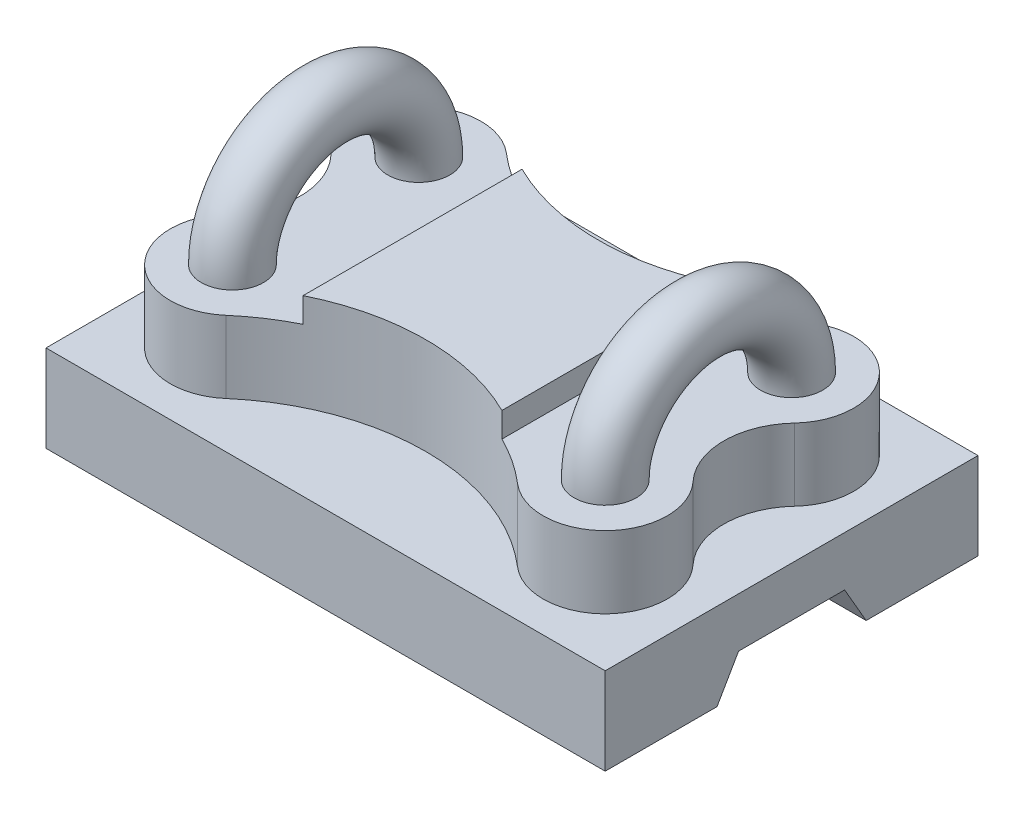
ISO-10303-21;
HEADER;
FILE_DESCRIPTION(('STEP AP214'),'2;1');
FILE_NAME('part.step','',(''),(''),'','','');
FILE_SCHEMA(('AUTOMOTIVE_DESIGN { 1 0 10303 214 1 1 1 1 }'));
ENDSEC;
DATA;
#1=APPLICATION_CONTEXT('core data for automotive mechanical design processes');
#2=APPLICATION_PROTOCOL_DEFINITION('international standard','automotive_design',2000,#1);
#3=PRODUCT_CONTEXT('',#1,'mechanical');
#4=PRODUCT('Part','Part','',(#3));
#5=PRODUCT_RELATED_PRODUCT_CATEGORY('part','',(#4));
#6=PRODUCT_DEFINITION_FORMATION('','',#4);
#7=PRODUCT_DEFINITION_CONTEXT('part definition',#1,'design');
#8=PRODUCT_DEFINITION('design','',#6,#7);
#9=PRODUCT_DEFINITION_SHAPE('','',#8);
#10=(LENGTH_UNIT() NAMED_UNIT(*) SI_UNIT(.MILLI.,.METRE.));
#11=(NAMED_UNIT(*) PLANE_ANGLE_UNIT() SI_UNIT($,.RADIAN.));
#12=(NAMED_UNIT(*) SI_UNIT($,.STERADIAN.) SOLID_ANGLE_UNIT());
#13=UNCERTAINTY_MEASURE_WITH_UNIT(LENGTH_MEASURE(1.E-05),#10,'distance_accuracy_value','');
#14=(GEOMETRIC_REPRESENTATION_CONTEXT(3) GLOBAL_UNCERTAINTY_ASSIGNED_CONTEXT((#13)) GLOBAL_UNIT_ASSIGNED_CONTEXT((#10,
#11,#12)) REPRESENTATION_CONTEXT('',''));
#15=CARTESIAN_POINT('',(0.,0.,0.));
#16=DIRECTION('',(0.,0.,1.));
#17=DIRECTION('',(1.,0.,0.));
#18=AXIS2_PLACEMENT_3D('',#15,#16,#17);
#19=CARTESIAN_POINT('',(0.,128.,0.));
#20=DIRECTION('',(0.,1.,0.));
#21=DIRECTION('',(0.,0.,1.));
#22=AXIS2_PLACEMENT_3D('',#19,#20,#21);
#23=PLANE('',#22);
#24=CARTESIAN_POINT('',(150.,128.,-74.9999999999999));
#25=DIRECTION('',(0.,1.,0.));
#26=DIRECTION('',(0.,0.,-1.));
#27=AXIS2_PLACEMENT_3D('',#24,#25,#26);
#28=CIRCLE('',#27,25.);
#29=CARTESIAN_POINT('',(150.,128.,-100.));
#30=VERTEX_POINT('',#29);
#31=EDGE_CURVE('E452',#30,#30,#28,.T.);
#32=ORIENTED_EDGE('',*,*,#31,.F.);
#33=EDGE_LOOP('',(#32));
#34=FACE_BOUND('',#33,.T.);
#35=CARTESIAN_POINT('',(150.,127.999999999999,74.9999999999999));
#36=DIRECTION('',(0.,-1.,0.));
#37=DIRECTION('',(0.,0.,1.));
#38=AXIS2_PLACEMENT_3D('',#35,#36,#37);
#39=CIRCLE('',#38,25.);
#40=CARTESIAN_POINT('',(150.,127.999999999999,99.9999999999999));
#41=VERTEX_POINT('',#40);
#42=EDGE_CURVE('E448',#41,#41,#39,.T.);
#43=ORIENTED_EDGE('',*,*,#42,.T.);
#44=EDGE_LOOP('',(#43));
#45=FACE_BOUND('',#44,.T.);
#46=DIRECTION('',(0.,0.,-1.));
#47=VECTOR('',#46,1.);
#48=CARTESIAN_POINT('',(80.,128.,-88.110802775656));
#49=LINE('',#48,#47);
#50=CARTESIAN_POINT('',(80.,128.,88.110802775656));
#51=VERTEX_POINT('',#50);
#52=CARTESIAN_POINT('',(80.,128.,-88.110802775656));
#53=VERTEX_POINT('',#52);
#54=EDGE_CURVE('E201',#51,#53,#49,.T.);
#55=ORIENTED_EDGE('',*,*,#54,.F.);
#56=CARTESIAN_POINT('',(0.,128.,249.355957741627));
#57=DIRECTION('',(0.,1.,0.));
#58=DIRECTION('',(0.,0.,1.));
#59=AXIS2_PLACEMENT_3D('',#56,#57,#58);
#60=CIRCLE('',#59,180.);
#61=CARTESIAN_POINT('',(117.391304347826,128.,112.903469074267));
#62=VERTEX_POINT('',#61);
#63=EDGE_CURVE('E221',#51,#62,#60,.F.);
#64=ORIENTED_EDGE('',*,*,#63,.T.);
#65=CARTESIAN_POINT('',(150.,128.,75.));
#66=DIRECTION('',(0.,1.,0.));
#67=DIRECTION('',(0.,0.,1.));
#68=AXIS2_PLACEMENT_3D('',#65,#66,#67);
#69=CIRCLE('',#68,50.);
#70=CARTESIAN_POINT('',(186.576083953252,128.,40.9090909090909));
#71=VERTEX_POINT('',#70);
#72=EDGE_CURVE('E226',#62,#71,#69,.T.);
#73=ORIENTED_EDGE('',*,*,#72,.T.);
#74=CARTESIAN_POINT('',(230.467384697155,128.,0.));
#75=DIRECTION('',(0.,1.,0.));
#76=DIRECTION('',(0.,0.,1.));
#77=AXIS2_PLACEMENT_3D('',#74,#75,#76);
#78=CIRCLE('',#77,60.);
#79=CARTESIAN_POINT('',(186.576083953252,128.,-40.9090909090909));
#80=VERTEX_POINT('',#79);
#81=EDGE_CURVE('E229',#71,#80,#78,.F.);
#82=ORIENTED_EDGE('',*,*,#81,.T.);
#83=CARTESIAN_POINT('',(150.,128.,-75.));
#84=DIRECTION('',(0.,1.,0.));
#85=DIRECTION('',(0.,0.,1.));
#86=AXIS2_PLACEMENT_3D('',#83,#84,#85);
#87=CIRCLE('',#86,50.);
#88=CARTESIAN_POINT('',(117.391304347826,128.,-112.903469074267));
#89=VERTEX_POINT('',#88);
#90=EDGE_CURVE('E232',#89,#80,#87,.F.);
#91=ORIENTED_EDGE('',*,*,#90,.F.);
#92=CARTESIAN_POINT('',(0.,128.,-249.355957741627));
#93=DIRECTION('',(0.,1.,0.));
#94=DIRECTION('',(0.,0.,1.));
#95=AXIS2_PLACEMENT_3D('',#92,#93,#94);
#96=CIRCLE('',#95,180.);
#97=EDGE_CURVE('E57',#53,#89,#96,.T.);
#98=ORIENTED_EDGE('',*,*,#97,.F.);
#99=EDGE_LOOP('',(#55,#64,#73,#82,#91,#98));
#100=FACE_BOUND('',#99,.T.);
#101=ADVANCED_FACE('F41',(#34,#45,#100),#23,.T.);
#102=CARTESIAN_POINT('',(225.,70.,-150.));
#103=DIRECTION('',(-1.,0.,0.));
#104=DIRECTION('',(0.,0.,1.));
#105=AXIS2_PLACEMENT_3D('',#102,#103,#104);
#106=PLANE('',#105);
#107=DIRECTION('',(0.,0.86602540378444,-0.499999999999998));
#108=VECTOR('',#107,1.);
#109=CARTESIAN_POINT('',(225.,0.,60.));
#110=LINE('',#109,#108);
#111=CARTESIAN_POINT('',(225.,0.,60.));
#112=VERTEX_POINT('',#111);
#113=CARTESIAN_POINT('',(225.,30.,42.6794919243113));
#114=VERTEX_POINT('',#113);
#115=EDGE_CURVE('E300',#112,#114,#110,.T.);
#116=ORIENTED_EDGE('',*,*,#115,.T.);
#117=DIRECTION('',(0.,0.,-1.));
#118=VECTOR('',#117,1.);
#119=CARTESIAN_POINT('',(225.,30.,42.6794919243113));
#120=LINE('',#119,#118);
#121=CARTESIAN_POINT('',(225.,30.,-42.6794919243113));
#122=VERTEX_POINT('',#121);
#123=EDGE_CURVE('E316',#114,#122,#120,.T.);
#124=ORIENTED_EDGE('',*,*,#123,.T.);
#125=DIRECTION('',(0.,0.86602540378444,0.499999999999998));
#126=VECTOR('',#125,1.);
#127=CARTESIAN_POINT('',(225.,0.,-60.));
#128=LINE('',#127,#126);
#129=CARTESIAN_POINT('',(225.,0.,-60.));
#130=VERTEX_POINT('',#129);
#131=EDGE_CURVE('E305',#130,#122,#128,.T.);
#132=ORIENTED_EDGE('',*,*,#131,.F.);
#133=DIRECTION('',(0.,0.,-1.));
#134=VECTOR('',#133,1.);
#135=CARTESIAN_POINT('',(225.,0.,-150.));
#136=LINE('',#135,#134);
#137=CARTESIAN_POINT('',(225.,0.,-150.));
#138=VERTEX_POINT('',#137);
#139=EDGE_CURVE('E336',#130,#138,#136,.T.);
#140=ORIENTED_EDGE('',*,*,#139,.T.);
#141=DIRECTION('',(0.,-1.,0.));
#142=VECTOR('',#141,1.);
#143=CARTESIAN_POINT('',(225.,70.,-150.));
#144=LINE('',#143,#142);
#145=CARTESIAN_POINT('',(225.,70.,-150.));
#146=VERTEX_POINT('',#145);
#147=EDGE_CURVE('E11',#146,#138,#144,.T.);
#148=ORIENTED_EDGE('',*,*,#147,.F.);
#149=DIRECTION('',(0.,0.,-1.));
#150=VECTOR('',#149,1.);
#151=CARTESIAN_POINT('',(225.,70.,-150.));
#152=LINE('',#151,#150);
#153=CARTESIAN_POINT('',(225.,70.,150.));
#154=VERTEX_POINT('',#153);
#155=EDGE_CURVE('E337',#154,#146,#152,.T.);
#156=ORIENTED_EDGE('',*,*,#155,.F.);
#157=DIRECTION('',(0.,-1.,0.));
#158=VECTOR('',#157,1.);
#159=CARTESIAN_POINT('',(225.,70.,150.));
#160=LINE('',#159,#158);
#161=CARTESIAN_POINT('',(225.,0.,150.));
#162=VERTEX_POINT('',#161);
#163=EDGE_CURVE('E351',#154,#162,#160,.T.);
#164=ORIENTED_EDGE('',*,*,#163,.T.);
#165=EDGE_CURVE('E352',#162,#112,#136,.T.);
#166=ORIENTED_EDGE('',*,*,#165,.T.);
#167=EDGE_LOOP('',(#116,#124,#132,#140,#148,#156,#164,#166));
#168=FACE_BOUND('',#167,.T.);
#169=ADVANCED_FACE('F43',(#168),#106,.F.);
#170=CARTESIAN_POINT('',(-225.,70.,-150.));
#171=DIRECTION('',(1.,0.,0.));
#172=DIRECTION('',(0.,0.,-1.));
#173=AXIS2_PLACEMENT_3D('',#170,#171,#172);
#174=PLANE('',#173);
#175=DIRECTION('',(0.,0.86602540378444,-0.499999999999998));
#176=VECTOR('',#175,1.);
#177=CARTESIAN_POINT('',(-225.,0.,60.));
#178=LINE('',#177,#176);
#179=CARTESIAN_POINT('',(-225.,0.,60.));
#180=VERTEX_POINT('',#179);
#181=CARTESIAN_POINT('',(-225.,30.,42.6794919243113));
#182=VERTEX_POINT('',#181);
#183=EDGE_CURVE('E301',#180,#182,#178,.T.);
#184=ORIENTED_EDGE('',*,*,#183,.F.);
#185=DIRECTION('',(0.,0.,1.));
#186=VECTOR('',#185,1.);
#187=CARTESIAN_POINT('',(-225.,0.,-150.));
#188=LINE('',#187,#186);
#189=CARTESIAN_POINT('',(-225.,0.,150.));
#190=VERTEX_POINT('',#189);
#191=EDGE_CURVE('E359',#180,#190,#188,.T.);
#192=ORIENTED_EDGE('',*,*,#191,.T.);
#193=DIRECTION('',(0.,-1.,0.));
#194=VECTOR('',#193,1.);
#195=CARTESIAN_POINT('',(-225.,70.,150.));
#196=LINE('',#195,#194);
#197=CARTESIAN_POINT('',(-225.,70.,150.));
#198=VERTEX_POINT('',#197);
#199=EDGE_CURVE('E369',#198,#190,#196,.T.);
#200=ORIENTED_EDGE('',*,*,#199,.F.);
#201=DIRECTION('',(0.,0.,1.));
#202=VECTOR('',#201,1.);
#203=CARTESIAN_POINT('',(-225.,70.,-150.));
#204=LINE('',#203,#202);
#205=CARTESIAN_POINT('',(-225.,70.,-150.));
#206=VERTEX_POINT('',#205);
#207=EDGE_CURVE('E345',#206,#198,#204,.T.);
#208=ORIENTED_EDGE('',*,*,#207,.F.);
#209=DIRECTION('',(0.,-1.,0.));
#210=VECTOR('',#209,1.);
#211=CARTESIAN_POINT('',(-225.,70.,-150.));
#212=LINE('',#211,#210);
#213=CARTESIAN_POINT('',(-225.,0.,-150.));
#214=VERTEX_POINT('',#213);
#215=EDGE_CURVE('E50',#206,#214,#212,.T.);
#216=ORIENTED_EDGE('',*,*,#215,.T.);
#217=CARTESIAN_POINT('',(-225.,0.,-60.));
#218=VERTEX_POINT('',#217);
#219=EDGE_CURVE('E360',#214,#218,#188,.T.);
#220=ORIENTED_EDGE('',*,*,#219,.T.);
#221=DIRECTION('',(0.,0.86602540378444,0.499999999999998));
#222=VECTOR('',#221,1.);
#223=CARTESIAN_POINT('',(-225.,0.,-60.));
#224=LINE('',#223,#222);
#225=CARTESIAN_POINT('',(-225.,30.,-42.6794919243113));
#226=VERTEX_POINT('',#225);
#227=EDGE_CURVE('E308',#218,#226,#224,.T.);
#228=ORIENTED_EDGE('',*,*,#227,.T.);
#229=DIRECTION('',(0.,0.,-1.));
#230=VECTOR('',#229,1.);
#231=CARTESIAN_POINT('',(-225.,30.,42.6794919243113));
#232=LINE('',#231,#230);
#233=EDGE_CURVE('E304',#182,#226,#232,.T.);
#234=ORIENTED_EDGE('',*,*,#233,.F.);
#235=EDGE_LOOP('',(#184,#192,#200,#208,#216,#220,#228,#234));
#236=FACE_BOUND('',#235,.T.);
#237=ADVANCED_FACE('F379',(#236),#174,.F.);
#238=CARTESIAN_POINT('',(0.,0.,0.));
#239=DIRECTION('',(0.,1.,0.));
#240=DIRECTION('',(0.,0.,1.));
#241=AXIS2_PLACEMENT_3D('',#238,#239,#240);
#242=PLANE('',#241);
#243=DIRECTION('',(1.,0.,0.));
#244=VECTOR('',#243,1.);
#245=CARTESIAN_POINT('',(-225.,0.,60.));
#246=LINE('',#245,#244);
#247=EDGE_CURVE('E312',#180,#112,#246,.T.);
#248=ORIENTED_EDGE('',*,*,#247,.T.);
#249=ORIENTED_EDGE('',*,*,#165,.F.);
#250=DIRECTION('',(1.,0.,0.));
#251=VECTOR('',#250,1.);
#252=CARTESIAN_POINT('',(-225.,0.,150.));
#253=LINE('',#252,#251);
#254=EDGE_CURVE('E342',#190,#162,#253,.T.);
#255=ORIENTED_EDGE('',*,*,#254,.F.);
#256=ORIENTED_EDGE('',*,*,#191,.F.);
#257=EDGE_LOOP('',(#248,#249,#255,#256));
#258=FACE_BOUND('',#257,.T.);
#259=ADVANCED_FACE('F402',(#258),#242,.F.);
#260=CARTESIAN_POINT('',(-225.,70.,-150.));
#261=DIRECTION('',(0.,0.,1.));
#262=DIRECTION('',(1.,0.,0.));
#263=AXIS2_PLACEMENT_3D('',#260,#261,#262);
#264=PLANE('',#263);
#265=DIRECTION('',(-1.,0.,0.));
#266=VECTOR('',#265,1.);
#267=CARTESIAN_POINT('',(-225.,0.,-150.));
#268=LINE('',#267,#266);
#269=EDGE_CURVE('E356',#138,#214,#268,.T.);
#270=ORIENTED_EDGE('',*,*,#269,.T.);
#271=ORIENTED_EDGE('',*,*,#215,.F.);
#272=DIRECTION('',(-1.,0.,0.));
#273=VECTOR('',#272,1.);
#274=CARTESIAN_POINT('',(-225.,70.,-150.));
#275=LINE('',#274,#273);
#276=EDGE_CURVE('E341',#146,#206,#275,.T.);
#277=ORIENTED_EDGE('',*,*,#276,.F.);
#278=ORIENTED_EDGE('',*,*,#147,.T.);
#279=EDGE_LOOP('',(#270,#271,#277,#278));
#280=FACE_BOUND('',#279,.T.);
#281=ADVANCED_FACE('F520',(#280),#264,.F.);
#282=CARTESIAN_POINT('',(-225.,70.,150.));
#283=DIRECTION('',(0.,0.,-1.));
#284=DIRECTION('',(-1.,0.,0.));
#285=AXIS2_PLACEMENT_3D('',#282,#283,#284);
#286=PLANE('',#285);
#287=ORIENTED_EDGE('',*,*,#254,.T.);
#288=ORIENTED_EDGE('',*,*,#163,.F.);
#289=DIRECTION('',(1.,0.,0.));
#290=VECTOR('',#289,1.);
#291=CARTESIAN_POINT('',(-225.,70.,150.));
#292=LINE('',#291,#290);
#293=EDGE_CURVE('E348',#198,#154,#292,.T.);
#294=ORIENTED_EDGE('',*,*,#293,.F.);
#295=ORIENTED_EDGE('',*,*,#199,.T.);
#296=EDGE_LOOP('',(#287,#288,#294,#295));
#297=FACE_BOUND('',#296,.T.);
#298=ADVANCED_FACE('F514',(#297),#286,.F.);
#299=CARTESIAN_POINT('',(0.,70.,0.));
#300=DIRECTION('',(0.,1.,0.));
#301=DIRECTION('',(0.,0.,1.));
#302=AXIS2_PLACEMENT_3D('',#299,#300,#301);
#303=PLANE('',#302);
#304=CARTESIAN_POINT('',(0.,70.,249.355957741627));
#305=DIRECTION('',(0.,1.,0.));
#306=DIRECTION('',(0.,0.,1.));
#307=AXIS2_PLACEMENT_3D('',#304,#305,#306);
#308=CIRCLE('',#307,180.);
#309=CARTESIAN_POINT('',(-117.391304347826,70.,112.903469074267));
#310=VERTEX_POINT('',#309);
#311=CARTESIAN_POINT('',(117.391304347826,70.,112.903469074267));
#312=VERTEX_POINT('',#311);
#313=EDGE_CURVE('E211',#310,#312,#308,.F.);
#314=ORIENTED_EDGE('',*,*,#313,.F.);
#315=CARTESIAN_POINT('',(-150.,70.,75.));
#316=DIRECTION('',(0.,1.,0.));
#317=DIRECTION('',(0.,0.,1.));
#318=AXIS2_PLACEMENT_3D('',#315,#316,#317);
#319=CIRCLE('',#318,50.);
#320=CARTESIAN_POINT('',(-186.576083953252,70.,40.9090909090909));
#321=VERTEX_POINT('',#320);
#322=EDGE_CURVE('E207',#310,#321,#319,.F.);
#323=ORIENTED_EDGE('',*,*,#322,.T.);
#324=CARTESIAN_POINT('',(-230.467384697155,70.,0.));
#325=DIRECTION('',(0.,1.,0.));
#326=DIRECTION('',(0.,0.,1.));
#327=AXIS2_PLACEMENT_3D('',#324,#325,#326);
#328=CIRCLE('',#327,60.);
#329=CARTESIAN_POINT('',(-186.576083953252,70.,-40.9090909090909));
#330=VERTEX_POINT('',#329);
#331=EDGE_CURVE('E222',#321,#330,#328,.T.);
#332=ORIENTED_EDGE('',*,*,#331,.T.);
#333=CARTESIAN_POINT('',(-150.,70.,-75.));
#334=DIRECTION('',(0.,1.,0.));
#335=DIRECTION('',(0.,0.,1.));
#336=AXIS2_PLACEMENT_3D('',#333,#334,#335);
#337=CIRCLE('',#336,50.);
#338=CARTESIAN_POINT('',(-117.391304347826,70.,-112.903469074267));
#339=VERTEX_POINT('',#338);
#340=EDGE_CURVE('E263',#339,#330,#337,.T.);
#341=ORIENTED_EDGE('',*,*,#340,.F.);
#342=CARTESIAN_POINT('',(0.,70.,-249.355957741627));
#343=DIRECTION('',(0.,1.,0.));
#344=DIRECTION('',(0.,0.,1.));
#345=AXIS2_PLACEMENT_3D('',#342,#343,#344);
#346=CIRCLE('',#345,180.);
#347=CARTESIAN_POINT('',(117.391304347826,70.,-112.903469074267));
#348=VERTEX_POINT('',#347);
#349=EDGE_CURVE('E260',#339,#348,#346,.T.);
#350=ORIENTED_EDGE('',*,*,#349,.T.);
#351=CARTESIAN_POINT('',(150.,70.,-75.));
#352=DIRECTION('',(0.,1.,0.));
#353=DIRECTION('',(0.,0.,1.));
#354=AXIS2_PLACEMENT_3D('',#351,#352,#353);
#355=CIRCLE('',#354,50.);
#356=CARTESIAN_POINT('',(186.576083953252,70.,-40.9090909090909));
#357=VERTEX_POINT('',#356);
#358=EDGE_CURVE('E257',#348,#357,#355,.F.);
#359=ORIENTED_EDGE('',*,*,#358,.T.);
#360=CARTESIAN_POINT('',(230.467384697155,70.,0.));
#361=DIRECTION('',(0.,1.,0.));
#362=DIRECTION('',(0.,0.,1.));
#363=AXIS2_PLACEMENT_3D('',#360,#361,#362);
#364=CIRCLE('',#363,60.);
#365=CARTESIAN_POINT('',(186.576083953252,70.,40.9090909090909));
#366=VERTEX_POINT('',#365);
#367=EDGE_CURVE('E253',#366,#357,#364,.F.);
#368=ORIENTED_EDGE('',*,*,#367,.F.);
#369=CARTESIAN_POINT('',(150.,70.,75.));
#370=DIRECTION('',(0.,1.,0.));
#371=DIRECTION('',(0.,0.,1.));
#372=AXIS2_PLACEMENT_3D('',#369,#370,#371);
#373=CIRCLE('',#372,50.);
#374=EDGE_CURVE('E249',#312,#366,#373,.T.);
#375=ORIENTED_EDGE('',*,*,#374,.F.);
#376=EDGE_LOOP('',(#314,#323,#332,#341,#350,#359,#368,#375));
#377=FACE_BOUND('',#376,.T.);
#378=ORIENTED_EDGE('',*,*,#155,.T.);
#379=ORIENTED_EDGE('',*,*,#276,.T.);
#380=ORIENTED_EDGE('',*,*,#207,.T.);
#381=ORIENTED_EDGE('',*,*,#293,.T.);
#382=EDGE_LOOP('',(#378,#379,#380,#381));
#383=FACE_BOUND('',#382,.T.);
#384=ADVANCED_FACE('F511',(#377,#383),#303,.T.);
#385=ORIENTED_EDGE('',*,*,#139,.F.);
#386=DIRECTION('',(1.,0.,0.));
#387=VECTOR('',#386,1.);
#388=CARTESIAN_POINT('',(-225.,0.,-60.));
#389=LINE('',#388,#387);
#390=EDGE_CURVE('E326',#218,#130,#389,.T.);
#391=ORIENTED_EDGE('',*,*,#390,.F.);
#392=ORIENTED_EDGE('',*,*,#219,.F.);
#393=ORIENTED_EDGE('',*,*,#269,.F.);
#394=EDGE_LOOP('',(#385,#391,#392,#393));
#395=FACE_BOUND('',#394,.T.);
#396=ADVANCED_FACE('F386',(#395),#242,.F.);
#397=CARTESIAN_POINT('',(-225.,0.,60.));
#398=DIRECTION('',(0.,-0.499999999999998,-0.86602540378444));
#399=DIRECTION('',(0.,0.86602540378444,-0.499999999999998));
#400=AXIS2_PLACEMENT_3D('',#397,#398,#399);
#401=PLANE('',#400);
#402=ORIENTED_EDGE('',*,*,#115,.F.);
#403=ORIENTED_EDGE('',*,*,#247,.F.);
#404=ORIENTED_EDGE('',*,*,#183,.T.);
#405=DIRECTION('',(1.,0.,0.));
#406=VECTOR('',#405,1.);
#407=CARTESIAN_POINT('',(-225.,30.,42.6794919243113));
#408=LINE('',#407,#406);
#409=EDGE_CURVE('E332',#182,#114,#408,.T.);
#410=ORIENTED_EDGE('',*,*,#409,.T.);
#411=EDGE_LOOP('',(#402,#403,#404,#410));
#412=FACE_BOUND('',#411,.T.);
#413=ADVANCED_FACE('F398',(#412),#401,.T.);
#414=CARTESIAN_POINT('',(-225.,30.,42.6794919243113));
#415=DIRECTION('',(0.,-1.,0.));
#416=DIRECTION('',(0.,0.,-1.));
#417=AXIS2_PLACEMENT_3D('',#414,#415,#416);
#418=PLANE('',#417);
#419=ORIENTED_EDGE('',*,*,#123,.F.);
#420=ORIENTED_EDGE('',*,*,#409,.F.);
#421=ORIENTED_EDGE('',*,*,#233,.T.);
#422=DIRECTION('',(1.,0.,0.));
#423=VECTOR('',#422,1.);
#424=CARTESIAN_POINT('',(-225.,30.,-42.6794919243113));
#425=LINE('',#424,#423);
#426=EDGE_CURVE('E329',#226,#122,#425,.T.);
#427=ORIENTED_EDGE('',*,*,#426,.T.);
#428=EDGE_LOOP('',(#419,#420,#421,#427));
#429=FACE_BOUND('',#428,.T.);
#430=ADVANCED_FACE('F395',(#429),#418,.T.);
#431=CARTESIAN_POINT('',(-225.,0.,-60.));
#432=DIRECTION('',(0.,0.499999999999998,-0.86602540378444));
#433=DIRECTION('',(0.,0.86602540378444,0.499999999999998));
#434=AXIS2_PLACEMENT_3D('',#431,#432,#433);
#435=PLANE('',#434);
#436=ORIENTED_EDGE('',*,*,#131,.T.);
#437=ORIENTED_EDGE('',*,*,#426,.F.);
#438=ORIENTED_EDGE('',*,*,#227,.F.);
#439=ORIENTED_EDGE('',*,*,#390,.T.);
#440=EDGE_LOOP('',(#436,#437,#438,#439));
#441=FACE_BOUND('',#440,.T.);
#442=ADVANCED_FACE('F389',(#441),#435,.F.);
#443=CARTESIAN_POINT('',(-150.,128.,75.));
#444=DIRECTION('',(0.,-1.,0.));
#445=DIRECTION('',(0.,0.,-1.));
#446=AXIS2_PLACEMENT_3D('',#443,#444,#445);
#447=CYLINDRICAL_SURFACE('',#446,50.);
#448=ORIENTED_EDGE('',*,*,#322,.F.);
#449=DIRECTION('',(0.,-1.,0.));
#450=VECTOR('',#449,1.);
#451=CARTESIAN_POINT('',(-117.391304347826,128.,112.903469074267));
#452=LINE('',#451,#450);
#453=CARTESIAN_POINT('',(-117.391304347826,128.,112.903469074267));
#454=VERTEX_POINT('',#453);
#455=EDGE_CURVE('E296',#454,#310,#452,.T.);
#456=ORIENTED_EDGE('',*,*,#455,.F.);
#457=CARTESIAN_POINT('',(-150.,128.,75.));
#458=DIRECTION('',(0.,1.,0.));
#459=DIRECTION('',(0.,0.,1.));
#460=AXIS2_PLACEMENT_3D('',#457,#458,#459);
#461=CIRCLE('',#460,50.);
#462=CARTESIAN_POINT('',(-186.576083953252,128.,40.9090909090909));
#463=VERTEX_POINT('',#462);
#464=EDGE_CURVE('E217',#454,#463,#461,.F.);
#465=ORIENTED_EDGE('',*,*,#464,.T.);
#466=DIRECTION('',(0.,-1.,0.));
#467=VECTOR('',#466,1.);
#468=CARTESIAN_POINT('',(-186.576083953252,128.,40.9090909090909));
#469=LINE('',#468,#467);
#470=EDGE_CURVE('E244',#463,#321,#469,.T.);
#471=ORIENTED_EDGE('',*,*,#470,.T.);
#472=EDGE_LOOP('',(#448,#456,#465,#471));
#473=FACE_BOUND('',#472,.T.);
#474=ADVANCED_FACE('F501',(#473),#447,.T.);
#475=CARTESIAN_POINT('',(0.,128.,249.355957741627));
#476=DIRECTION('',(0.,-1.,0.));
#477=DIRECTION('',(0.,0.,-1.));
#478=AXIS2_PLACEMENT_3D('',#475,#476,#477);
#479=CYLINDRICAL_SURFACE('',#478,180.);
#480=ORIENTED_EDGE('',*,*,#313,.T.);
#481=DIRECTION('',(0.,-1.,0.));
#482=VECTOR('',#481,1.);
#483=CARTESIAN_POINT('',(117.391304347826,128.,112.903469074267));
#484=LINE('',#483,#482);
#485=EDGE_CURVE('E292',#62,#312,#484,.T.);
#486=ORIENTED_EDGE('',*,*,#485,.F.);
#487=ORIENTED_EDGE('',*,*,#63,.F.);
#488=DIRECTION('',(0.,-1.,0.));
#489=VECTOR('',#488,1.);
#490=CARTESIAN_POINT('',(80.,148.,88.110802775656));
#491=LINE('',#490,#489);
#492=CARTESIAN_POINT('',(80.,148.,88.110802775656));
#493=VERTEX_POINT('',#492);
#494=EDGE_CURVE('E213',#493,#51,#491,.T.);
#495=ORIENTED_EDGE('',*,*,#494,.F.);
#496=CARTESIAN_POINT('',(0.,148.,249.355957741627));
#497=DIRECTION('',(0.,-1.,0.));
#498=DIRECTION('',(0.,0.,1.));
#499=AXIS2_PLACEMENT_3D('',#496,#497,#498);
#500=CIRCLE('',#499,180.);
#501=CARTESIAN_POINT('',(-80.,148.,88.110802775656));
#502=VERTEX_POINT('',#501);
#503=EDGE_CURVE('E190',#502,#493,#500,.T.);
#504=ORIENTED_EDGE('',*,*,#503,.F.);
#505=DIRECTION('',(0.,-1.,0.));
#506=VECTOR('',#505,1.);
#507=CARTESIAN_POINT('',(-80.,148.,88.110802775656));
#508=LINE('',#507,#506);
#509=CARTESIAN_POINT('',(-80.,128.,88.110802775656));
#510=VERTEX_POINT('',#509);
#511=EDGE_CURVE('E186',#502,#510,#508,.T.);
#512=ORIENTED_EDGE('',*,*,#511,.T.);
#513=EDGE_CURVE('E223',#454,#510,#60,.F.);
#514=ORIENTED_EDGE('',*,*,#513,.F.);
#515=ORIENTED_EDGE('',*,*,#455,.T.);
#516=EDGE_LOOP('',(#480,#486,#487,#495,#504,#512,#514,#515));
#517=FACE_BOUND('',#516,.T.);
#518=ADVANCED_FACE('F415',(#517),#479,.F.);
#519=CARTESIAN_POINT('',(150.,128.,75.));
#520=DIRECTION('',(0.,-1.,0.));
#521=DIRECTION('',(0.,0.,-1.));
#522=AXIS2_PLACEMENT_3D('',#519,#520,#521);
#523=CYLINDRICAL_SURFACE('',#522,50.);
#524=ORIENTED_EDGE('',*,*,#374,.T.);
#525=DIRECTION('',(0.,-1.,0.));
#526=VECTOR('',#525,1.);
#527=CARTESIAN_POINT('',(186.576083953252,128.,40.9090909090909));
#528=LINE('',#527,#526);
#529=EDGE_CURVE('E288',#71,#366,#528,.T.);
#530=ORIENTED_EDGE('',*,*,#529,.F.);
#531=ORIENTED_EDGE('',*,*,#72,.F.);
#532=ORIENTED_EDGE('',*,*,#485,.T.);
#533=EDGE_LOOP('',(#524,#530,#531,#532));
#534=FACE_BOUND('',#533,.T.);
#535=ADVANCED_FACE('F417',(#534),#523,.T.);
#536=CARTESIAN_POINT('',(230.467384697155,128.,0.));
#537=DIRECTION('',(0.,-1.,0.));
#538=DIRECTION('',(0.,0.,-1.));
#539=AXIS2_PLACEMENT_3D('',#536,#537,#538);
#540=CYLINDRICAL_SURFACE('',#539,60.);
#541=ORIENTED_EDGE('',*,*,#367,.T.);
#542=DIRECTION('',(0.,-1.,0.));
#543=VECTOR('',#542,1.);
#544=CARTESIAN_POINT('',(186.576083953252,128.,-40.9090909090909));
#545=LINE('',#544,#543);
#546=EDGE_CURVE('E284',#80,#357,#545,.T.);
#547=ORIENTED_EDGE('',*,*,#546,.F.);
#548=ORIENTED_EDGE('',*,*,#81,.F.);
#549=ORIENTED_EDGE('',*,*,#529,.T.);
#550=EDGE_LOOP('',(#541,#547,#548,#549));
#551=FACE_BOUND('',#550,.T.);
#552=ADVANCED_FACE('F421',(#551),#540,.F.);
#553=CARTESIAN_POINT('',(150.,128.,-75.));
#554=DIRECTION('',(0.,-1.,0.));
#555=DIRECTION('',(0.,0.,-1.));
#556=AXIS2_PLACEMENT_3D('',#553,#554,#555);
#557=CYLINDRICAL_SURFACE('',#556,50.);
#558=ORIENTED_EDGE('',*,*,#358,.F.);
#559=DIRECTION('',(0.,-1.,0.));
#560=VECTOR('',#559,1.);
#561=CARTESIAN_POINT('',(117.391304347826,128.,-112.903469074267));
#562=LINE('',#561,#560);
#563=EDGE_CURVE('E280',#89,#348,#562,.T.);
#564=ORIENTED_EDGE('',*,*,#563,.F.);
#565=ORIENTED_EDGE('',*,*,#90,.T.);
#566=ORIENTED_EDGE('',*,*,#546,.T.);
#567=EDGE_LOOP('',(#558,#564,#565,#566));
#568=FACE_BOUND('',#567,.T.);
#569=ADVANCED_FACE('F425',(#568),#557,.T.);
#570=CARTESIAN_POINT('',(0.,128.,-249.355957741627));
#571=DIRECTION('',(0.,-1.,0.));
#572=DIRECTION('',(0.,0.,-1.));
#573=AXIS2_PLACEMENT_3D('',#570,#571,#572);
#574=CYLINDRICAL_SURFACE('',#573,180.);
#575=ORIENTED_EDGE('',*,*,#349,.F.);
#576=DIRECTION('',(0.,-1.,0.));
#577=VECTOR('',#576,1.);
#578=CARTESIAN_POINT('',(-117.391304347826,128.,-112.903469074267));
#579=LINE('',#578,#577);
#580=CARTESIAN_POINT('',(-117.391304347826,128.,-112.903469074267));
#581=VERTEX_POINT('',#580);
#582=EDGE_CURVE('E276',#581,#339,#579,.T.);
#583=ORIENTED_EDGE('',*,*,#582,.F.);
#584=CARTESIAN_POINT('',(-80.,128.,-88.110802775656));
#585=VERTEX_POINT('',#584);
#586=EDGE_CURVE('E205',#581,#585,#96,.T.);
#587=ORIENTED_EDGE('',*,*,#586,.T.);
#588=DIRECTION('',(0.,-1.,0.));
#589=VECTOR('',#588,1.);
#590=CARTESIAN_POINT('',(-80.,148.,-88.110802775656));
#591=LINE('',#590,#589);
#592=CARTESIAN_POINT('',(-80.,148.,-88.110802775656));
#593=VERTEX_POINT('',#592);
#594=EDGE_CURVE('E184',#593,#585,#591,.T.);
#595=ORIENTED_EDGE('',*,*,#594,.F.);
#596=CARTESIAN_POINT('',(0.,148.,-249.355957741627));
#597=DIRECTION('',(0.,-1.,0.));
#598=DIRECTION('',(0.,0.,1.));
#599=AXIS2_PLACEMENT_3D('',#596,#597,#598);
#600=CIRCLE('',#599,180.);
#601=CARTESIAN_POINT('',(80.,148.,-88.110802775656));
#602=VERTEX_POINT('',#601);
#603=EDGE_CURVE('E191',#602,#593,#600,.T.);
#604=ORIENTED_EDGE('',*,*,#603,.F.);
#605=DIRECTION('',(0.,-1.,0.));
#606=VECTOR('',#605,1.);
#607=CARTESIAN_POINT('',(80.,148.,-88.110802775656));
#608=LINE('',#607,#606);
#609=EDGE_CURVE('E426',#602,#53,#608,.T.);
#610=ORIENTED_EDGE('',*,*,#609,.T.);
#611=ORIENTED_EDGE('',*,*,#97,.T.);
#612=ORIENTED_EDGE('',*,*,#563,.T.);
#613=EDGE_LOOP('',(#575,#583,#587,#595,#604,#610,#611,#612));
#614=FACE_BOUND('',#613,.T.);
#615=ADVANCED_FACE('F204',(#614),#574,.F.);
#616=CARTESIAN_POINT('',(-150.,128.,-75.));
#617=DIRECTION('',(0.,-1.,0.));
#618=DIRECTION('',(0.,0.,-1.));
#619=AXIS2_PLACEMENT_3D('',#616,#617,#618);
#620=CYLINDRICAL_SURFACE('',#619,50.);
#621=ORIENTED_EDGE('',*,*,#340,.T.);
#622=DIRECTION('',(0.,-1.,0.));
#623=VECTOR('',#622,1.);
#624=CARTESIAN_POINT('',(-186.576083953252,128.,-40.9090909090909));
#625=LINE('',#624,#623);
#626=CARTESIAN_POINT('',(-186.576083953252,128.,-40.9090909090909));
#627=VERTEX_POINT('',#626);
#628=EDGE_CURVE('E272',#627,#330,#625,.T.);
#629=ORIENTED_EDGE('',*,*,#628,.F.);
#630=CARTESIAN_POINT('',(-150.,128.,-75.));
#631=DIRECTION('',(0.,1.,0.));
#632=DIRECTION('',(0.,0.,1.));
#633=AXIS2_PLACEMENT_3D('',#630,#631,#632);
#634=CIRCLE('',#633,50.);
#635=EDGE_CURVE('E238',#581,#627,#634,.T.);
#636=ORIENTED_EDGE('',*,*,#635,.F.);
#637=ORIENTED_EDGE('',*,*,#582,.T.);
#638=EDGE_LOOP('',(#621,#629,#636,#637));
#639=FACE_BOUND('',#638,.T.);
#640=ADVANCED_FACE('F486',(#639),#620,.T.);
#641=CARTESIAN_POINT('',(-230.467384697155,128.,0.));
#642=DIRECTION('',(0.,-1.,0.));
#643=DIRECTION('',(0.,0.,-1.));
#644=AXIS2_PLACEMENT_3D('',#641,#642,#643);
#645=CYLINDRICAL_SURFACE('',#644,60.);
#646=ORIENTED_EDGE('',*,*,#331,.F.);
#647=ORIENTED_EDGE('',*,*,#470,.F.);
#648=CARTESIAN_POINT('',(-230.467384697155,128.,0.));
#649=DIRECTION('',(0.,1.,0.));
#650=DIRECTION('',(0.,0.,1.));
#651=AXIS2_PLACEMENT_3D('',#648,#649,#650);
#652=CIRCLE('',#651,60.);
#653=EDGE_CURVE('E241',#463,#627,#652,.T.);
#654=ORIENTED_EDGE('',*,*,#653,.T.);
#655=ORIENTED_EDGE('',*,*,#628,.T.);
#656=EDGE_LOOP('',(#646,#647,#654,#655));
#657=FACE_BOUND('',#656,.T.);
#658=ADVANCED_FACE('F482',(#657),#645,.F.);
#659=CARTESIAN_POINT('',(-150.,128.,-75.));
#660=DIRECTION('',(0.,1.,0.));
#661=DIRECTION('',(0.,0.,1.));
#662=AXIS2_PLACEMENT_3D('',#659,#660,#661);
#663=CIRCLE('',#662,25.);
#664=CARTESIAN_POINT('',(-150.,128.,-100.));
#665=VERTEX_POINT('',#664);
#666=EDGE_CURVE('E444',#665,#665,#663,.T.);
#667=ORIENTED_EDGE('',*,*,#666,.F.);
#668=EDGE_LOOP('',(#667));
#669=FACE_BOUND('',#668,.T.);
#670=CARTESIAN_POINT('',(-150.,127.999999999999,75.));
#671=DIRECTION('',(0.,-1.,0.));
#672=DIRECTION('',(0.,0.,-1.));
#673=AXIS2_PLACEMENT_3D('',#670,#671,#672);
#674=CIRCLE('',#673,25.);
#675=CARTESIAN_POINT('',(-150.,127.999999999999,100.));
#676=VERTEX_POINT('',#675);
#677=EDGE_CURVE('E437',#676,#676,#674,.T.);
#678=ORIENTED_EDGE('',*,*,#677,.T.);
#679=EDGE_LOOP('',(#678));
#680=FACE_BOUND('',#679,.T.);
#681=DIRECTION('',(0.,0.,1.));
#682=VECTOR('',#681,1.);
#683=CARTESIAN_POINT('',(-80.,128.,-88.110802775656));
#684=LINE('',#683,#682);
#685=EDGE_CURVE('E65',#585,#510,#684,.T.);
#686=ORIENTED_EDGE('',*,*,#685,.F.);
#687=ORIENTED_EDGE('',*,*,#586,.F.);
#688=ORIENTED_EDGE('',*,*,#635,.T.);
#689=ORIENTED_EDGE('',*,*,#653,.F.);
#690=ORIENTED_EDGE('',*,*,#464,.F.);
#691=ORIENTED_EDGE('',*,*,#513,.T.);
#692=EDGE_LOOP('',(#686,#687,#688,#689,#690,#691));
#693=FACE_BOUND('',#692,.T.);
#694=ADVANCED_FACE('F462',(#669,#680,#693),#23,.T.);
#695=CARTESIAN_POINT('',(-80.,148.,-88.110802775656));
#696=DIRECTION('',(1.,0.,0.));
#697=DIRECTION('',(0.,0.,-1.));
#698=AXIS2_PLACEMENT_3D('',#695,#696,#697);
#699=PLANE('',#698);
#700=ORIENTED_EDGE('',*,*,#685,.T.);
#701=ORIENTED_EDGE('',*,*,#511,.F.);
#702=DIRECTION('',(0.,0.,1.));
#703=VECTOR('',#702,1.);
#704=CARTESIAN_POINT('',(-80.,148.,-88.110802775656));
#705=LINE('',#704,#703);
#706=EDGE_CURVE('E180',#593,#502,#705,.T.);
#707=ORIENTED_EDGE('',*,*,#706,.F.);
#708=ORIENTED_EDGE('',*,*,#594,.T.);
#709=EDGE_LOOP('',(#700,#701,#707,#708));
#710=FACE_BOUND('',#709,.T.);
#711=ADVANCED_FACE('F182',(#710),#699,.F.);
#712=CARTESIAN_POINT('',(80.,148.,-88.110802775656));
#713=DIRECTION('',(-1.,0.,0.));
#714=DIRECTION('',(0.,0.,1.));
#715=AXIS2_PLACEMENT_3D('',#712,#713,#714);
#716=PLANE('',#715);
#717=ORIENTED_EDGE('',*,*,#54,.T.);
#718=ORIENTED_EDGE('',*,*,#609,.F.);
#719=DIRECTION('',(0.,0.,-1.));
#720=VECTOR('',#719,1.);
#721=CARTESIAN_POINT('',(80.,148.,-88.110802775656));
#722=LINE('',#721,#720);
#723=EDGE_CURVE('E196',#493,#602,#722,.T.);
#724=ORIENTED_EDGE('',*,*,#723,.F.);
#725=ORIENTED_EDGE('',*,*,#494,.T.);
#726=EDGE_LOOP('',(#717,#718,#724,#725));
#727=FACE_BOUND('',#726,.T.);
#728=ADVANCED_FACE('F476',(#727),#716,.F.);
#729=CARTESIAN_POINT('',(0.,148.,-249.355957741627));
#730=DIRECTION('',(0.,1.,0.));
#731=DIRECTION('',(0.,0.,1.));
#732=AXIS2_PLACEMENT_3D('',#729,#730,#731);
#733=PLANE('',#732);
#734=ORIENTED_EDGE('',*,*,#603,.T.);
#735=ORIENTED_EDGE('',*,*,#706,.T.);
#736=ORIENTED_EDGE('',*,*,#503,.T.);
#737=ORIENTED_EDGE('',*,*,#723,.T.);
#738=EDGE_LOOP('',(#734,#735,#736,#737));
#739=FACE_BOUND('',#738,.T.);
#740=ADVANCED_FACE('F194',(#739),#733,.T.);
#741=CARTESIAN_POINT('',(-150.,128.,0.));
#742=DIRECTION('',(-1.,0.,0.));
#743=DIRECTION('',(0.,0.,1.));
#744=AXIS2_PLACEMENT_3D('',#741,#742,#743);
#745=TOROIDAL_SURFACE('',#744,75.,25.);
#746=CARTESIAN_POINT('',(-150.,128.,0.));
#747=DIRECTION('',(-1.,0.,0.));
#748=DIRECTION('',(0.,0.,1.));
#749=AXIS2_PLACEMENT_3D('',#746,#747,#748);
#750=CIRCLE('',#749,100.);
#751=EDGE_CURVE('',#676,#665,#750,.T.);
#752=ORIENTED_EDGE('',*,*,#677,.F.);
#753=ORIENTED_EDGE('',*,*,#666,.T.);
#754=ORIENTED_EDGE('',*,*,#751,.T.);
#755=ORIENTED_EDGE('',*,*,#751,.F.);
#756=EDGE_LOOP('',(#752,#754,#753,#755));
#757=FACE_BOUND('',#756,.T.);
#758=ADVANCED_FACE('F466',(#757),#745,.T.);
#759=CARTESIAN_POINT('',(150.,128.,0.));
#760=DIRECTION('',(-1.,0.,0.));
#761=DIRECTION('',(0.,0.,1.));
#762=AXIS2_PLACEMENT_3D('',#759,#760,#761);
#763=TOROIDAL_SURFACE('',#762,74.9999999999999,25.);
#764=CARTESIAN_POINT('',(150.,128.,0.));
#765=DIRECTION('',(-1.,0.,0.));
#766=DIRECTION('',(0.,0.,1.));
#767=AXIS2_PLACEMENT_3D('',#764,#765,#766);
#768=CIRCLE('',#767,99.9999999999999);
#769=EDGE_CURVE('',#41,#30,#768,.T.);
#770=ORIENTED_EDGE('',*,*,#42,.F.);
#771=ORIENTED_EDGE('',*,*,#31,.T.);
#772=ORIENTED_EDGE('',*,*,#769,.T.);
#773=ORIENTED_EDGE('',*,*,#769,.F.);
#774=EDGE_LOOP('',(#770,#772,#771,#773));
#775=FACE_BOUND('',#774,.T.);
#776=ADVANCED_FACE('F457',(#775),#763,.T.);
#777=CLOSED_SHELL('',(#101,#169,#237,#259,#281,#298,#384,#396,#413,#430,#442,#474,#518,#535,
#552,#569,#615,#640,#658,#694,#711,#728,#740,#758,#776));
#778=MANIFOLD_SOLID_BREP('B2',#777);
#779=ADVANCED_BREP_SHAPE_REPRESENTATION('',(#18,#778),#14);
#780=SHAPE_DEFINITION_REPRESENTATION(#9,#779);
ENDSEC;
END-ISO-10303-21;
